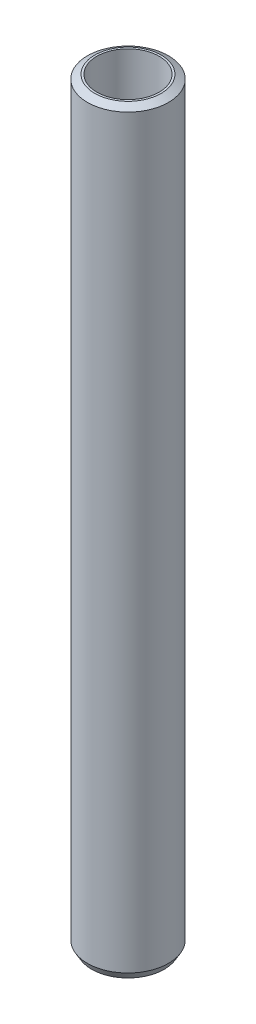
ISO-10303-21;
HEADER;
FILE_DESCRIPTION(('STEP AP214'),'2;1');
FILE_NAME('part.step','',(''),(''),'','','');
FILE_SCHEMA(('AUTOMOTIVE_DESIGN { 1 0 10303 214 1 1 1 1 }'));
ENDSEC;
DATA;
#1=APPLICATION_CONTEXT('core data for automotive mechanical design processes');
#2=APPLICATION_PROTOCOL_DEFINITION('international standard','automotive_design',2000,#1);
#3=PRODUCT_CONTEXT('',#1,'mechanical');
#4=PRODUCT('Part','Part','',(#3));
#5=PRODUCT_RELATED_PRODUCT_CATEGORY('part','',(#4));
#6=PRODUCT_DEFINITION_FORMATION('','',#4);
#7=PRODUCT_DEFINITION_CONTEXT('part definition',#1,'design');
#8=PRODUCT_DEFINITION('design','',#6,#7);
#9=PRODUCT_DEFINITION_SHAPE('','',#8);
#10=(LENGTH_UNIT() NAMED_UNIT(*) SI_UNIT(.MILLI.,.METRE.));
#11=(NAMED_UNIT(*) PLANE_ANGLE_UNIT() SI_UNIT($,.RADIAN.));
#12=(NAMED_UNIT(*) SI_UNIT($,.STERADIAN.) SOLID_ANGLE_UNIT());
#13=UNCERTAINTY_MEASURE_WITH_UNIT(LENGTH_MEASURE(1.E-05),#10,'distance_accuracy_value','');
#14=(GEOMETRIC_REPRESENTATION_CONTEXT(3) GLOBAL_UNCERTAINTY_ASSIGNED_CONTEXT((#13)) GLOBAL_UNIT_ASSIGNED_CONTEXT((#10,
#11,#12)) REPRESENTATION_CONTEXT('',''));
#15=CARTESIAN_POINT('',(0.,0.,0.));
#16=DIRECTION('',(0.,0.,1.));
#17=DIRECTION('',(1.,0.,0.));
#18=AXIS2_PLACEMENT_3D('',#15,#16,#17);
#19=CARTESIAN_POINT('',(0.,327.097514475601,0.));
#20=DIRECTION('',(0.,-1.,0.));
#21=DIRECTION('',(0.,0.,-1.));
#22=AXIS2_PLACEMENT_3D('',#19,#20,#21);
#23=CYLINDRICAL_SURFACE('',#22,17.5);
#24=CARTESIAN_POINT('',(0.,325.283947897597,0.));
#25=DIRECTION('',(0.,1.,0.));
#26=DIRECTION('',(0.,0.,1.));
#27=AXIS2_PLACEMENT_3D('',#24,#25,#26);
#28=CIRCLE('',#27,17.5);
#29=CARTESIAN_POINT('',(0.,325.283947897597,17.5));
#30=VERTEX_POINT('',#29);
#31=EDGE_CURVE('E50',#30,#30,#28,.F.);
#32=ORIENTED_EDGE('',*,*,#31,.T.);
#33=EDGE_LOOP('',(#32));
#34=FACE_BOUND('',#33,.T.);
#35=CARTESIAN_POINT('',(0.,3.14118945601249,0.));
#36=DIRECTION('',(0.,1.,0.));
#37=DIRECTION('',(0.,0.,1.));
#38=AXIS2_PLACEMENT_3D('',#35,#36,#37);
#39=CIRCLE('',#38,17.5);
#40=CARTESIAN_POINT('',(0.,3.14118945601249,17.5));
#41=VERTEX_POINT('',#40);
#42=EDGE_CURVE('E51',#41,#41,#39,.T.);
#43=ORIENTED_EDGE('',*,*,#42,.T.);
#44=EDGE_LOOP('',(#43));
#45=FACE_BOUND('',#44,.T.);
#46=ADVANCED_FACE('F39',(#34,#45),#23,.T.);
#47=CARTESIAN_POINT('',(0.,327.097514475601,0.));
#48=DIRECTION('',(0.,1.,0.));
#49=DIRECTION('',(0.,0.,1.));
#50=AXIS2_PLACEMENT_3D('',#47,#48,#49);
#51=PLANE('',#50);
#52=CARTESIAN_POINT('',(0.,327.097514475601,0.));
#53=DIRECTION('',(0.,1.,0.));
#54=DIRECTION('',(0.,0.,1.));
#55=AXIS2_PLACEMENT_3D('',#52,#53,#54);
#56=CIRCLE('',#55,14.3588105439874);
#57=CARTESIAN_POINT('',(0.,327.097514475601,14.3588105439874));
#58=VERTEX_POINT('',#57);
#59=EDGE_CURVE('E54',#58,#58,#56,.T.);
#60=ORIENTED_EDGE('',*,*,#59,.T.);
#61=EDGE_LOOP('',(#60));
#62=FACE_BOUND('',#61,.T.);
#63=CARTESIAN_POINT('',(0.,327.097514475601,0.));
#64=DIRECTION('',(0.,1.,0.));
#65=DIRECTION('',(0.,0.,1.));
#66=AXIS2_PLACEMENT_3D('',#63,#64,#65);
#67=CIRCLE('',#66,13.4671844894746);
#68=CARTESIAN_POINT('',(0.,327.097514475601,13.4671844894746));
#69=VERTEX_POINT('',#68);
#70=EDGE_CURVE('E58',#69,#69,#67,.T.);
#71=ORIENTED_EDGE('',*,*,#70,.F.);
#72=EDGE_LOOP('',(#71));
#73=FACE_BOUND('',#72,.T.);
#74=ADVANCED_FACE('F69',(#62,#73),#51,.T.);
#75=CARTESIAN_POINT('',(0.,0.,0.));
#76=DIRECTION('',(0.,1.,0.));
#77=DIRECTION('',(0.,0.,1.));
#78=AXIS2_PLACEMENT_3D('',#75,#76,#77);
#79=PLANE('',#78);
#80=CARTESIAN_POINT('',(0.,0.,0.));
#81=DIRECTION('',(0.,1.,0.));
#82=DIRECTION('',(0.,0.,1.));
#83=AXIS2_PLACEMENT_3D('',#80,#81,#82);
#84=CIRCLE('',#83,15.6864334219955);
#85=CARTESIAN_POINT('',(0.,0.,15.6864334219955));
#86=VERTEX_POINT('',#85);
#87=EDGE_CURVE('E10',#86,#86,#84,.F.);
#88=ORIENTED_EDGE('',*,*,#87,.T.);
#89=EDGE_LOOP('',(#88));
#90=FACE_BOUND('',#89,.T.);
#91=CARTESIAN_POINT('',(0.,0.,0.));
#92=DIRECTION('',(0.,1.,0.));
#93=DIRECTION('',(0.,0.,1.));
#94=AXIS2_PLACEMENT_3D('',#91,#92,#93);
#95=CIRCLE('',#94,13.4671844894746);
#96=CARTESIAN_POINT('',(0.,0.,13.4671844894746));
#97=VERTEX_POINT('',#96);
#98=EDGE_CURVE('E63',#97,#97,#95,.T.);
#99=ORIENTED_EDGE('',*,*,#98,.T.);
#100=EDGE_LOOP('',(#99));
#101=FACE_BOUND('',#100,.T.);
#102=ADVANCED_FACE('F75',(#90,#101),#79,.F.);
#103=CARTESIAN_POINT('',(0.,327.097514475601,0.));
#104=DIRECTION('',(0.,-1.,0.));
#105=DIRECTION('',(0.,0.,-1.));
#106=AXIS2_PLACEMENT_3D('',#103,#104,#105);
#107=CYLINDRICAL_SURFACE('',#106,13.4671844894746);
#108=ORIENTED_EDGE('',*,*,#70,.T.);
#109=EDGE_LOOP('',(#108));
#110=FACE_BOUND('',#109,.T.);
#111=ORIENTED_EDGE('',*,*,#98,.F.);
#112=EDGE_LOOP('',(#111));
#113=FACE_BOUND('',#112,.T.);
#114=ADVANCED_FACE('F70',(#110,#113),#107,.F.);
#115=CARTESIAN_POINT('',(0.,327.097514475601,0.));
#116=DIRECTION('',(0.,-1.,0.));
#117=DIRECTION('',(0.,0.,-1.));
#118=AXIS2_PLACEMENT_3D('',#115,#116,#117);
#119=CONICAL_SURFACE('',#118,14.3588105439874,1.0471975511966);
#120=ORIENTED_EDGE('',*,*,#31,.F.);
#121=EDGE_LOOP('',(#120));
#122=FACE_BOUND('',#121,.T.);
#123=ORIENTED_EDGE('',*,*,#59,.F.);
#124=EDGE_LOOP('',(#123));
#125=FACE_BOUND('',#124,.T.);
#126=ADVANCED_FACE('F81',(#122,#125),#119,.T.);
#127=CARTESIAN_POINT('',(0.,3.14118945601249,0.));
#128=DIRECTION('',(0.,1.,0.));
#129=DIRECTION('',(0.,0.,1.));
#130=AXIS2_PLACEMENT_3D('',#127,#128,#129);
#131=CONICAL_SURFACE('',#130,17.5,0.523598775598306);
#132=ORIENTED_EDGE('',*,*,#87,.F.);
#133=EDGE_LOOP('',(#132));
#134=FACE_BOUND('',#133,.T.);
#135=ORIENTED_EDGE('',*,*,#42,.F.);
#136=EDGE_LOOP('',(#135));
#137=FACE_BOUND('',#136,.T.);
#138=ADVANCED_FACE('F45',(#134,#137),#131,.T.);
#139=CLOSED_SHELL('',(#46,#74,#102,#114,#126,#138));
#140=MANIFOLD_SOLID_BREP('B2',#139);
#141=ADVANCED_BREP_SHAPE_REPRESENTATION('',(#18,#140),#14);
#142=SHAPE_DEFINITION_REPRESENTATION(#9,#141);
ENDSEC;
END-ISO-10303-21;
